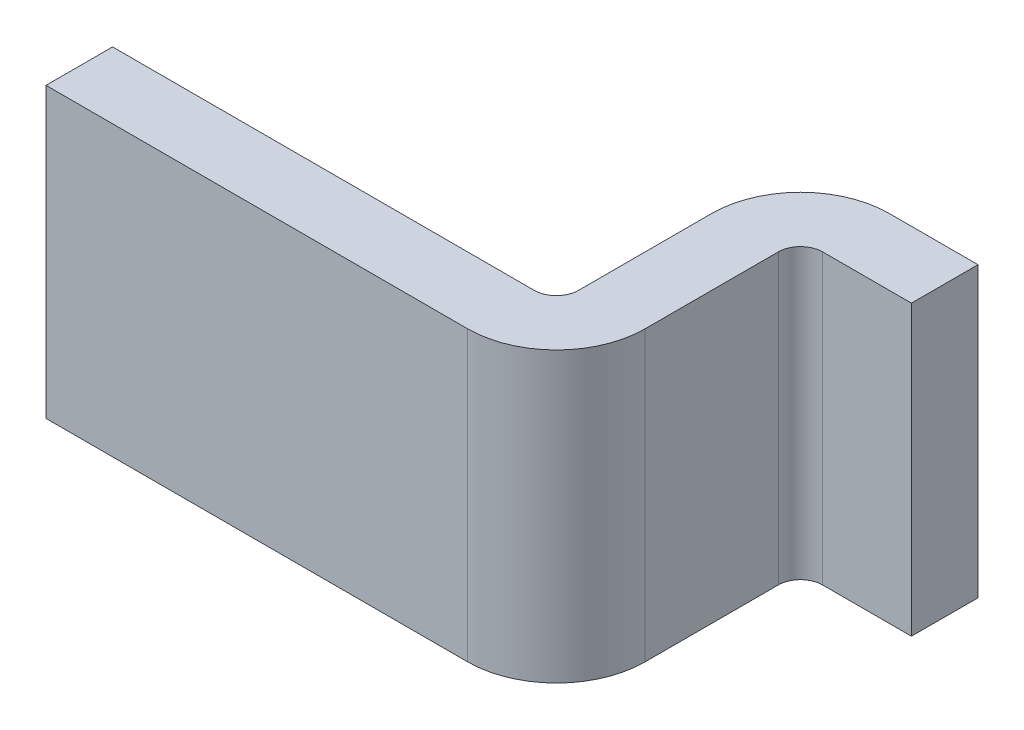
ISO-10303-21;
HEADER;
FILE_DESCRIPTION(('STEP AP214'),'2;1');
FILE_NAME('part.step','',(''),(''),'','','');
FILE_SCHEMA(('AUTOMOTIVE_DESIGN { 1 0 10303 214 1 1 1 1 }'));
ENDSEC;
DATA;
#1=APPLICATION_CONTEXT('core data for automotive mechanical design processes');
#2=APPLICATION_PROTOCOL_DEFINITION('international standard','automotive_design',2000,#1);
#3=PRODUCT_CONTEXT('',#1,'mechanical');
#4=PRODUCT('Part','Part','',(#3));
#5=PRODUCT_RELATED_PRODUCT_CATEGORY('part','',(#4));
#6=PRODUCT_DEFINITION_FORMATION('','',#4);
#7=PRODUCT_DEFINITION_CONTEXT('part definition',#1,'design');
#8=PRODUCT_DEFINITION('design','',#6,#7);
#9=PRODUCT_DEFINITION_SHAPE('','',#8);
#10=(LENGTH_UNIT() NAMED_UNIT(*) SI_UNIT(.MILLI.,.METRE.));
#11=(NAMED_UNIT(*) PLANE_ANGLE_UNIT() SI_UNIT($,.RADIAN.));
#12=(NAMED_UNIT(*) SI_UNIT($,.STERADIAN.) SOLID_ANGLE_UNIT());
#13=UNCERTAINTY_MEASURE_WITH_UNIT(LENGTH_MEASURE(1.E-05),#10,'distance_accuracy_value','');
#14=(GEOMETRIC_REPRESENTATION_CONTEXT(3) GLOBAL_UNCERTAINTY_ASSIGNED_CONTEXT((#13)) GLOBAL_UNIT_ASSIGNED_CONTEXT((#10,
#11,#12)) REPRESENTATION_CONTEXT('',''));
#15=CARTESIAN_POINT('',(0.,0.,0.));
#16=DIRECTION('',(0.,0.,1.));
#17=DIRECTION('',(1.,0.,0.));
#18=AXIS2_PLACEMENT_3D('',#15,#16,#17);
#19=CARTESIAN_POINT('',(1.225,-0.325,0.2));
#20=DIRECTION('',(0.,-1.,0.));
#21=DIRECTION('',(0.,0.,-1.));
#22=AXIS2_PLACEMENT_3D('',#19,#20,#21);
#23=CYLINDRICAL_SURFACE('',#22,0.05);
#24=CARTESIAN_POINT('',(1.225,-0.325,0.2));
#25=DIRECTION('',(0.,-1.,0.));
#26=DIRECTION('',(0.,0.,-1.));
#27=AXIS2_PLACEMENT_3D('',#24,#25,#26);
#28=CIRCLE('',#27,0.05);
#29=CARTESIAN_POINT('',(1.175,-0.325,0.2));
#30=VERTEX_POINT('',#29);
#31=CARTESIAN_POINT('',(1.225,-0.325,0.15));
#32=VERTEX_POINT('',#31);
#33=EDGE_CURVE('E166',#30,#32,#28,.T.);
#34=ORIENTED_EDGE('',*,*,#33,.T.);
#35=DIRECTION('',(0.,1.,0.));
#36=VECTOR('',#35,1.);
#37=CARTESIAN_POINT('',(1.225,0.325,0.15));
#38=LINE('',#37,#36);
#39=CARTESIAN_POINT('',(1.225,0.325,0.15));
#40=VERTEX_POINT('',#39);
#41=EDGE_CURVE('E192',#32,#40,#38,.T.);
#42=ORIENTED_EDGE('',*,*,#41,.T.);
#43=CARTESIAN_POINT('',(1.225,0.325,0.2));
#44=DIRECTION('',(0.,1.,0.));
#45=DIRECTION('',(0.,0.,-1.));
#46=AXIS2_PLACEMENT_3D('',#43,#44,#45);
#47=CIRCLE('',#46,0.05);
#48=CARTESIAN_POINT('',(1.175,0.325,0.2));
#49=VERTEX_POINT('',#48);
#50=EDGE_CURVE('E10',#40,#49,#47,.T.);
#51=ORIENTED_EDGE('',*,*,#50,.T.);
#52=DIRECTION('',(0.,-1.,0.));
#53=VECTOR('',#52,1.);
#54=CARTESIAN_POINT('',(1.175,-0.325,0.2));
#55=LINE('',#54,#53);
#56=EDGE_CURVE('E218',#49,#30,#55,.T.);
#57=ORIENTED_EDGE('',*,*,#56,.T.);
#58=EDGE_LOOP('',(#34,#42,#51,#57));
#59=FACE_BOUND('',#58,.T.);
#60=ADVANCED_FACE('F15',(#59),#23,.F.);
#61=CARTESIAN_POINT('',(0.975,-0.325,0.5));
#62=DIRECTION('',(0.,-1.,0.));
#63=DIRECTION('',(0.,0.,-1.));
#64=AXIS2_PLACEMENT_3D('',#61,#62,#63);
#65=CYLINDRICAL_SURFACE('',#64,0.05);
#66=CARTESIAN_POINT('',(0.975,-0.325,0.5));
#67=DIRECTION('',(0.,-1.,0.));
#68=DIRECTION('',(0.,0.,-1.));
#69=AXIS2_PLACEMENT_3D('',#66,#67,#68);
#70=CIRCLE('',#69,0.05);
#71=CARTESIAN_POINT('',(1.025,-0.325,0.5));
#72=VERTEX_POINT('',#71);
#73=CARTESIAN_POINT('',(0.975,-0.325,0.55));
#74=VERTEX_POINT('',#73);
#75=EDGE_CURVE('E189',#72,#74,#70,.T.);
#76=ORIENTED_EDGE('',*,*,#75,.T.);
#77=DIRECTION('',(0.,1.,0.));
#78=VECTOR('',#77,1.);
#79=CARTESIAN_POINT('',(0.975,0.325,0.55));
#80=LINE('',#79,#78);
#81=CARTESIAN_POINT('',(0.975,0.325,0.55));
#82=VERTEX_POINT('',#81);
#83=EDGE_CURVE('E151',#74,#82,#80,.T.);
#84=ORIENTED_EDGE('',*,*,#83,.T.);
#85=CARTESIAN_POINT('',(0.975,0.325,0.5));
#86=DIRECTION('',(0.,1.,0.));
#87=DIRECTION('',(0.,0.,-1.));
#88=AXIS2_PLACEMENT_3D('',#85,#86,#87);
#89=CIRCLE('',#88,0.05);
#90=CARTESIAN_POINT('',(1.025,0.325,0.5));
#91=VERTEX_POINT('',#90);
#92=EDGE_CURVE('E232',#82,#91,#89,.T.);
#93=ORIENTED_EDGE('',*,*,#92,.T.);
#94=DIRECTION('',(0.,-1.,0.));
#95=VECTOR('',#94,1.);
#96=CARTESIAN_POINT('',(1.025,-0.325,0.5));
#97=LINE('',#96,#95);
#98=EDGE_CURVE('E153',#91,#72,#97,.T.);
#99=ORIENTED_EDGE('',*,*,#98,.T.);
#100=EDGE_LOOP('',(#76,#84,#93,#99));
#101=FACE_BOUND('',#100,.T.);
#102=ADVANCED_FACE('F471',(#101),#65,.F.);
#103=CARTESIAN_POINT('',(1.225,-0.325,0.2));
#104=DIRECTION('',(0.,1.,0.));
#105=DIRECTION('',(0.,0.,1.));
#106=AXIS2_PLACEMENT_3D('',#103,#104,#105);
#107=CYLINDRICAL_SURFACE('',#106,0.2);
#108=CARTESIAN_POINT('',(1.225,-0.325,0.2));
#109=DIRECTION('',(0.,1.,0.));
#110=DIRECTION('',(0.,0.,-1.));
#111=AXIS2_PLACEMENT_3D('',#108,#109,#110);
#112=CIRCLE('',#111,0.2);
#113=CARTESIAN_POINT('',(1.225,-0.325,0.));
#114=VERTEX_POINT('',#113);
#115=CARTESIAN_POINT('',(1.025,-0.325,0.2));
#116=VERTEX_POINT('',#115);
#117=EDGE_CURVE('E163',#114,#116,#112,.T.);
#118=ORIENTED_EDGE('',*,*,#117,.T.);
#119=DIRECTION('',(0.,1.,0.));
#120=VECTOR('',#119,1.);
#121=CARTESIAN_POINT('',(1.025,-0.325,0.2));
#122=LINE('',#121,#120);
#123=CARTESIAN_POINT('',(1.025,0.325,0.2));
#124=VERTEX_POINT('',#123);
#125=EDGE_CURVE('E184',#116,#124,#122,.T.);
#126=ORIENTED_EDGE('',*,*,#125,.T.);
#127=CARTESIAN_POINT('',(1.225,0.325,0.2));
#128=DIRECTION('',(0.,-1.,0.));
#129=DIRECTION('',(0.,0.,-1.));
#130=AXIS2_PLACEMENT_3D('',#127,#128,#129);
#131=CIRCLE('',#130,0.2);
#132=CARTESIAN_POINT('',(1.225,0.325,0.));
#133=VERTEX_POINT('',#132);
#134=EDGE_CURVE('E207',#124,#133,#131,.T.);
#135=ORIENTED_EDGE('',*,*,#134,.T.);
#136=DIRECTION('',(0.,-1.,0.));
#137=VECTOR('',#136,1.);
#138=CARTESIAN_POINT('',(1.225,-0.325,0.));
#139=LINE('',#138,#137);
#140=EDGE_CURVE('E199',#133,#114,#139,.T.);
#141=ORIENTED_EDGE('',*,*,#140,.T.);
#142=EDGE_LOOP('',(#118,#126,#135,#141));
#143=FACE_BOUND('',#142,.T.);
#144=ADVANCED_FACE('F462',(#143),#107,.T.);
#145=CARTESIAN_POINT('',(0.975,-0.325,0.5));
#146=DIRECTION('',(0.,1.,0.));
#147=DIRECTION('',(0.,0.,1.));
#148=AXIS2_PLACEMENT_3D('',#145,#146,#147);
#149=CYLINDRICAL_SURFACE('',#148,0.2);
#150=CARTESIAN_POINT('',(0.975,-0.325,0.5));
#151=DIRECTION('',(0.,1.,0.));
#152=DIRECTION('',(0.,0.,-1.));
#153=AXIS2_PLACEMENT_3D('',#150,#151,#152);
#154=CIRCLE('',#153,0.2);
#155=CARTESIAN_POINT('',(0.975,-0.325,0.7));
#156=VERTEX_POINT('',#155);
#157=CARTESIAN_POINT('',(1.175,-0.325,0.5));
#158=VERTEX_POINT('',#157);
#159=EDGE_CURVE('E169',#156,#158,#154,.T.);
#160=ORIENTED_EDGE('',*,*,#159,.T.);
#161=DIRECTION('',(0.,1.,0.));
#162=VECTOR('',#161,1.);
#163=CARTESIAN_POINT('',(1.175,-0.325,0.5));
#164=LINE('',#163,#162);
#165=CARTESIAN_POINT('',(1.175,0.325,0.5));
#166=VERTEX_POINT('',#165);
#167=EDGE_CURVE('E204',#158,#166,#164,.T.);
#168=ORIENTED_EDGE('',*,*,#167,.T.);
#169=CARTESIAN_POINT('',(0.975,0.325,0.5));
#170=DIRECTION('',(0.,-1.,0.));
#171=DIRECTION('',(0.,0.,-1.));
#172=AXIS2_PLACEMENT_3D('',#169,#170,#171);
#173=CIRCLE('',#172,0.2);
#174=CARTESIAN_POINT('',(0.975,0.325,0.7));
#175=VERTEX_POINT('',#174);
#176=EDGE_CURVE('E25',#166,#175,#173,.T.);
#177=ORIENTED_EDGE('',*,*,#176,.T.);
#178=DIRECTION('',(0.,-1.,0.));
#179=VECTOR('',#178,1.);
#180=CARTESIAN_POINT('',(0.975,-0.325,0.7));
#181=LINE('',#180,#179);
#182=EDGE_CURVE('E18',#175,#156,#181,.T.);
#183=ORIENTED_EDGE('',*,*,#182,.T.);
#184=EDGE_LOOP('',(#160,#168,#177,#183));
#185=FACE_BOUND('',#184,.T.);
#186=ADVANCED_FACE('F276',(#185),#149,.T.);
#187=CARTESIAN_POINT('',(0.725,0.325,0.35));
#188=DIRECTION('',(0.,-1.,0.));
#189=DIRECTION('',(0.,0.,-1.));
#190=AXIS2_PLACEMENT_3D('',#187,#188,#189);
#191=PLANE('',#190);
#192=DIRECTION('',(-1.,0.,0.));
#193=VECTOR('',#192,1.);
#194=CARTESIAN_POINT('',(1.3,0.325,0.15));
#195=LINE('',#194,#193);
#196=CARTESIAN_POINT('',(1.425,0.325,0.15));
#197=VERTEX_POINT('',#196);
#198=EDGE_CURVE('E195',#197,#40,#195,.T.);
#199=ORIENTED_EDGE('',*,*,#198,.F.);
#200=DIRECTION('',(0.,0.,1.));
#201=VECTOR('',#200,1.);
#202=CARTESIAN_POINT('',(1.425,0.325,0.075));
#203=LINE('',#202,#201);
#204=CARTESIAN_POINT('',(1.425,0.325,0.));
#205=VERTEX_POINT('',#204);
#206=EDGE_CURVE('E170',#205,#197,#203,.T.);
#207=ORIENTED_EDGE('',*,*,#206,.F.);
#208=DIRECTION('',(1.,0.,0.));
#209=VECTOR('',#208,1.);
#210=CARTESIAN_POINT('',(1.225,0.325,0.));
#211=LINE('',#210,#209);
#212=EDGE_CURVE('E183',#133,#205,#211,.T.);
#213=ORIENTED_EDGE('',*,*,#212,.F.);
#214=ORIENTED_EDGE('',*,*,#134,.F.);
#215=DIRECTION('',(0.,0.,-1.));
#216=VECTOR('',#215,1.);
#217=CARTESIAN_POINT('',(1.025,0.325,0.275));
#218=LINE('',#217,#216);
#219=EDGE_CURVE('E188',#91,#124,#218,.T.);
#220=ORIENTED_EDGE('',*,*,#219,.F.);
#221=ORIENTED_EDGE('',*,*,#92,.F.);
#222=DIRECTION('',(1.,0.,0.));
#223=VECTOR('',#222,1.);
#224=CARTESIAN_POINT('',(0.525,0.325,0.55));
#225=LINE('',#224,#223);
#226=CARTESIAN_POINT('',(0.0250000000000007,0.325,0.55));
#227=VERTEX_POINT('',#226);
#228=EDGE_CURVE('E146',#227,#82,#225,.T.);
#229=ORIENTED_EDGE('',*,*,#228,.F.);
#230=DIRECTION('',(0.,0.,-1.));
#231=VECTOR('',#230,1.);
#232=CARTESIAN_POINT('',(0.0250000000000006,0.325,0.625));
#233=LINE('',#232,#231);
#234=CARTESIAN_POINT('',(0.0250000000000006,0.325,0.7));
#235=VERTEX_POINT('',#234);
#236=EDGE_CURVE('E136',#235,#227,#233,.T.);
#237=ORIENTED_EDGE('',*,*,#236,.F.);
#238=DIRECTION('',(-1.,0.,0.));
#239=VECTOR('',#238,1.);
#240=CARTESIAN_POINT('',(0.6,0.325,0.7));
#241=LINE('',#240,#239);
#242=EDGE_CURVE('E214',#175,#235,#241,.T.);
#243=ORIENTED_EDGE('',*,*,#242,.F.);
#244=ORIENTED_EDGE('',*,*,#176,.F.);
#245=DIRECTION('',(0.,0.,1.));
#246=VECTOR('',#245,1.);
#247=CARTESIAN_POINT('',(1.175,0.325,0.425));
#248=LINE('',#247,#246);
#249=EDGE_CURVE('E200',#49,#166,#248,.T.);
#250=ORIENTED_EDGE('',*,*,#249,.F.);
#251=ORIENTED_EDGE('',*,*,#50,.F.);
#252=EDGE_LOOP('',(#199,#207,#213,#214,#220,#221,#229,#237,#243,#244,#250,#251));
#253=FACE_BOUND('',#252,.T.);
#254=ADVANCED_FACE('F280',(#253),#191,.F.);
#255=CARTESIAN_POINT('',(0.725,-0.325,0.35));
#256=DIRECTION('',(0.,-1.,0.));
#257=DIRECTION('',(0.,0.,-1.));
#258=AXIS2_PLACEMENT_3D('',#255,#256,#257);
#259=PLANE('',#258);
#260=DIRECTION('',(-1.,0.,0.));
#261=VECTOR('',#260,1.);
#262=CARTESIAN_POINT('',(0.6,-0.325,0.7));
#263=LINE('',#262,#261);
#264=CARTESIAN_POINT('',(0.0250000000000006,-0.325,0.7));
#265=VERTEX_POINT('',#264);
#266=EDGE_CURVE('E130',#156,#265,#263,.T.);
#267=ORIENTED_EDGE('',*,*,#266,.T.);
#268=DIRECTION('',(0.,0.,-1.));
#269=VECTOR('',#268,1.);
#270=CARTESIAN_POINT('',(0.0250000000000006,-0.325,0.625));
#271=LINE('',#270,#269);
#272=CARTESIAN_POINT('',(0.0250000000000007,-0.325,0.55));
#273=VERTEX_POINT('',#272);
#274=EDGE_CURVE('E124',#265,#273,#271,.T.);
#275=ORIENTED_EDGE('',*,*,#274,.T.);
#276=DIRECTION('',(1.,0.,0.));
#277=VECTOR('',#276,1.);
#278=CARTESIAN_POINT('',(0.525,-0.325,0.55));
#279=LINE('',#278,#277);
#280=EDGE_CURVE('E128',#273,#74,#279,.T.);
#281=ORIENTED_EDGE('',*,*,#280,.T.);
#282=ORIENTED_EDGE('',*,*,#75,.F.);
#283=DIRECTION('',(0.,0.,-1.));
#284=VECTOR('',#283,1.);
#285=CARTESIAN_POINT('',(1.025,-0.325,0.275));
#286=LINE('',#285,#284);
#287=EDGE_CURVE('E160',#72,#116,#286,.T.);
#288=ORIENTED_EDGE('',*,*,#287,.T.);
#289=ORIENTED_EDGE('',*,*,#117,.F.);
#290=DIRECTION('',(1.,0.,0.));
#291=VECTOR('',#290,1.);
#292=CARTESIAN_POINT('',(1.225,-0.325,0.));
#293=LINE('',#292,#291);
#294=CARTESIAN_POINT('',(1.425,-0.325,0.));
#295=VERTEX_POINT('',#294);
#296=EDGE_CURVE('E196',#114,#295,#293,.T.);
#297=ORIENTED_EDGE('',*,*,#296,.T.);
#298=DIRECTION('',(0.,0.,1.));
#299=VECTOR('',#298,1.);
#300=CARTESIAN_POINT('',(1.425,-0.325,0.075));
#301=LINE('',#300,#299);
#302=CARTESIAN_POINT('',(1.425,-0.325,0.15));
#303=VERTEX_POINT('',#302);
#304=EDGE_CURVE('E178',#295,#303,#301,.T.);
#305=ORIENTED_EDGE('',*,*,#304,.T.);
#306=DIRECTION('',(-1.,0.,0.));
#307=VECTOR('',#306,1.);
#308=CARTESIAN_POINT('',(1.3,-0.325,0.15));
#309=LINE('',#308,#307);
#310=EDGE_CURVE('E222',#303,#32,#309,.T.);
#311=ORIENTED_EDGE('',*,*,#310,.T.);
#312=ORIENTED_EDGE('',*,*,#33,.F.);
#313=DIRECTION('',(0.,0.,1.));
#314=VECTOR('',#313,1.);
#315=CARTESIAN_POINT('',(1.175,-0.325,0.425));
#316=LINE('',#315,#314);
#317=EDGE_CURVE('E223',#30,#158,#316,.T.);
#318=ORIENTED_EDGE('',*,*,#317,.T.);
#319=ORIENTED_EDGE('',*,*,#159,.F.);
#320=EDGE_LOOP('',(#267,#275,#281,#282,#288,#289,#297,#305,#311,#312,#318,#319));
#321=FACE_BOUND('',#320,.T.);
#322=ADVANCED_FACE('F126',(#321),#259,.T.);
#323=CARTESIAN_POINT('',(1.3,-0.325,0.15));
#324=DIRECTION('',(0.,0.,1.));
#325=DIRECTION('',(1.,0.,0.));
#326=AXIS2_PLACEMENT_3D('',#323,#324,#325);
#327=PLANE('',#326);
#328=ORIENTED_EDGE('',*,*,#310,.F.);
#329=DIRECTION('',(0.,1.,0.));
#330=VECTOR('',#329,1.);
#331=CARTESIAN_POINT('',(1.425,-0.325,0.15));
#332=LINE('',#331,#330);
#333=EDGE_CURVE('E174',#303,#197,#332,.T.);
#334=ORIENTED_EDGE('',*,*,#333,.T.);
#335=ORIENTED_EDGE('',*,*,#198,.T.);
#336=ORIENTED_EDGE('',*,*,#41,.F.);
#337=EDGE_LOOP('',(#328,#334,#335,#336));
#338=FACE_BOUND('',#337,.T.);
#339=ADVANCED_FACE('F426',(#338),#327,.T.);
#340=CARTESIAN_POINT('',(1.175,-0.325,0.425));
#341=DIRECTION('',(1.,0.,0.));
#342=DIRECTION('',(0.,0.,-1.));
#343=AXIS2_PLACEMENT_3D('',#340,#341,#342);
#344=PLANE('',#343);
#345=ORIENTED_EDGE('',*,*,#249,.T.);
#346=ORIENTED_EDGE('',*,*,#167,.F.);
#347=ORIENTED_EDGE('',*,*,#317,.F.);
#348=ORIENTED_EDGE('',*,*,#56,.F.);
#349=EDGE_LOOP('',(#345,#346,#347,#348));
#350=FACE_BOUND('',#349,.T.);
#351=ADVANCED_FACE('F414',(#350),#344,.T.);
#352=CARTESIAN_POINT('',(0.6,-0.325,0.7));
#353=DIRECTION('',(0.,0.,1.));
#354=DIRECTION('',(1.,0.,0.));
#355=AXIS2_PLACEMENT_3D('',#352,#353,#354);
#356=PLANE('',#355);
#357=ORIENTED_EDGE('',*,*,#242,.T.);
#358=DIRECTION('',(0.,1.,0.));
#359=VECTOR('',#358,1.);
#360=CARTESIAN_POINT('',(0.0250000000000006,-0.325,0.7));
#361=LINE('',#360,#359);
#362=EDGE_CURVE('E135',#265,#235,#361,.T.);
#363=ORIENTED_EDGE('',*,*,#362,.F.);
#364=ORIENTED_EDGE('',*,*,#266,.F.);
#365=ORIENTED_EDGE('',*,*,#182,.F.);
#366=EDGE_LOOP('',(#357,#363,#364,#365));
#367=FACE_BOUND('',#366,.T.);
#368=ADVANCED_FACE('F279',(#367),#356,.T.);
#369=CARTESIAN_POINT('',(0.0250000000000006,-0.325,0.625));
#370=DIRECTION('',(-1.,0.,0.));
#371=DIRECTION('',(0.,1.,0.));
#372=AXIS2_PLACEMENT_3D('',#369,#370,#371);
#373=PLANE('',#372);
#374=ORIENTED_EDGE('',*,*,#236,.T.);
#375=DIRECTION('',(0.,1.,0.));
#376=VECTOR('',#375,1.);
#377=CARTESIAN_POINT('',(0.0250000000000007,-0.325,0.55));
#378=LINE('',#377,#376);
#379=EDGE_CURVE('E139',#273,#227,#378,.T.);
#380=ORIENTED_EDGE('',*,*,#379,.F.);
#381=ORIENTED_EDGE('',*,*,#274,.F.);
#382=ORIENTED_EDGE('',*,*,#362,.T.);
#383=EDGE_LOOP('',(#374,#380,#381,#382));
#384=FACE_BOUND('',#383,.T.);
#385=ADVANCED_FACE('F140',(#384),#373,.T.);
#386=CARTESIAN_POINT('',(0.525,-0.325,0.55));
#387=DIRECTION('',(0.,0.,-1.));
#388=DIRECTION('',(-1.,0.,0.));
#389=AXIS2_PLACEMENT_3D('',#386,#387,#388);
#390=PLANE('',#389);
#391=ORIENTED_EDGE('',*,*,#280,.F.);
#392=ORIENTED_EDGE('',*,*,#379,.T.);
#393=ORIENTED_EDGE('',*,*,#228,.T.);
#394=ORIENTED_EDGE('',*,*,#83,.F.);
#395=EDGE_LOOP('',(#391,#392,#393,#394));
#396=FACE_BOUND('',#395,.T.);
#397=ADVANCED_FACE('F149',(#396),#390,.T.);
#398=CARTESIAN_POINT('',(1.025,-0.325,0.275));
#399=DIRECTION('',(-1.,0.,0.));
#400=DIRECTION('',(0.,1.,0.));
#401=AXIS2_PLACEMENT_3D('',#398,#399,#400);
#402=PLANE('',#401);
#403=ORIENTED_EDGE('',*,*,#219,.T.);
#404=ORIENTED_EDGE('',*,*,#125,.F.);
#405=ORIENTED_EDGE('',*,*,#287,.F.);
#406=ORIENTED_EDGE('',*,*,#98,.F.);
#407=EDGE_LOOP('',(#403,#404,#405,#406));
#408=FACE_BOUND('',#407,.T.);
#409=ADVANCED_FACE('F374',(#408),#402,.T.);
#410=CARTESIAN_POINT('',(1.225,-0.325,0.));
#411=DIRECTION('',(0.,0.,-1.));
#412=DIRECTION('',(0.,-1.,0.));
#413=AXIS2_PLACEMENT_3D('',#410,#411,#412);
#414=PLANE('',#413);
#415=ORIENTED_EDGE('',*,*,#212,.T.);
#416=DIRECTION('',(0.,1.,0.));
#417=VECTOR('',#416,1.);
#418=CARTESIAN_POINT('',(1.425,-0.325,0.));
#419=LINE('',#418,#417);
#420=EDGE_CURVE('E179',#295,#205,#419,.T.);
#421=ORIENTED_EDGE('',*,*,#420,.F.);
#422=ORIENTED_EDGE('',*,*,#296,.F.);
#423=ORIENTED_EDGE('',*,*,#140,.F.);
#424=EDGE_LOOP('',(#415,#421,#422,#423));
#425=FACE_BOUND('',#424,.T.);
#426=ADVANCED_FACE('F361',(#425),#414,.T.);
#427=CARTESIAN_POINT('',(1.425,-0.325,0.075));
#428=DIRECTION('',(1.,0.,0.));
#429=DIRECTION('',(0.,1.,0.));
#430=AXIS2_PLACEMENT_3D('',#427,#428,#429);
#431=PLANE('',#430);
#432=ORIENTED_EDGE('',*,*,#206,.T.);
#433=ORIENTED_EDGE('',*,*,#333,.F.);
#434=ORIENTED_EDGE('',*,*,#304,.F.);
#435=ORIENTED_EDGE('',*,*,#420,.T.);
#436=EDGE_LOOP('',(#432,#433,#434,#435));
#437=FACE_BOUND('',#436,.T.);
#438=ADVANCED_FACE('F355',(#437),#431,.T.);
#439=CLOSED_SHELL('',(#60,#102,#144,#186,#254,#322,#339,#351,#368,#385,#397,#409,#426,#438));
#440=MANIFOLD_SOLID_BREP('B1',#439);
#441=ADVANCED_BREP_SHAPE_REPRESENTATION('',(#18,#440),#14);
#442=SHAPE_DEFINITION_REPRESENTATION(#9,#441);
ENDSEC;
END-ISO-10303-21;
